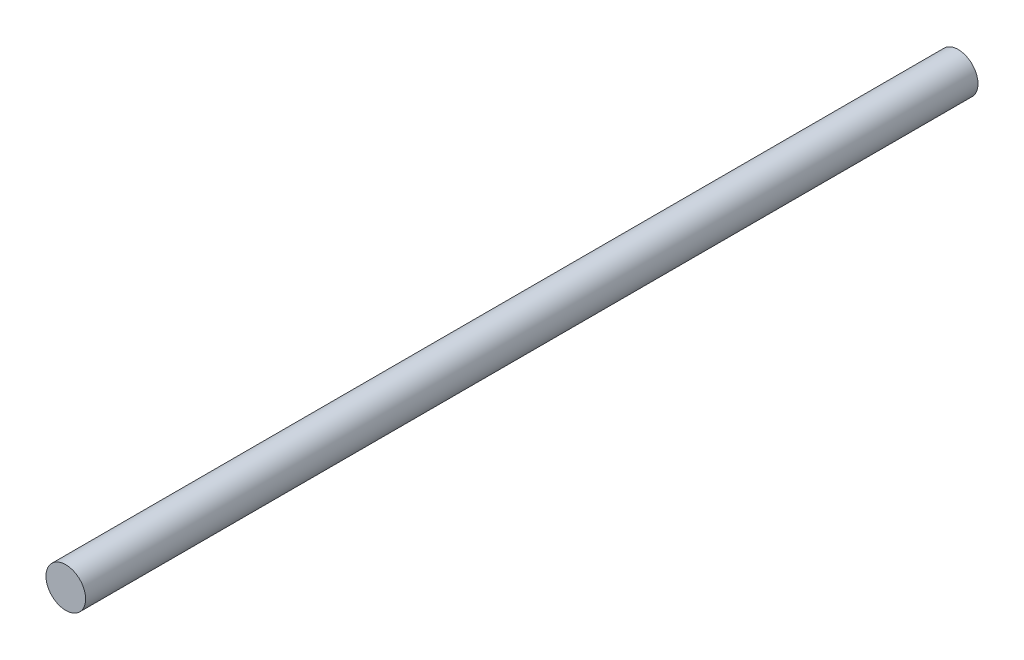
ISO-10303-21;
HEADER;
FILE_DESCRIPTION(('STEP AP214'),'2;1');
FILE_NAME('part.step','',(''),(''),'','','');
FILE_SCHEMA(('AUTOMOTIVE_DESIGN { 1 0 10303 214 1 1 1 1 }'));
ENDSEC;
DATA;
#1=APPLICATION_CONTEXT('core data for automotive mechanical design processes');
#2=APPLICATION_PROTOCOL_DEFINITION('international standard','automotive_design',2000,#1);
#3=PRODUCT_CONTEXT('',#1,'mechanical');
#4=PRODUCT('Part','Part','',(#3));
#5=PRODUCT_RELATED_PRODUCT_CATEGORY('part','',(#4));
#6=PRODUCT_DEFINITION_FORMATION('','',#4);
#7=PRODUCT_DEFINITION_CONTEXT('part definition',#1,'design');
#8=PRODUCT_DEFINITION('design','',#6,#7);
#9=PRODUCT_DEFINITION_SHAPE('','',#8);
#10=(LENGTH_UNIT() NAMED_UNIT(*) SI_UNIT(.MILLI.,.METRE.));
#11=(NAMED_UNIT(*) PLANE_ANGLE_UNIT() SI_UNIT($,.RADIAN.));
#12=(NAMED_UNIT(*) SI_UNIT($,.STERADIAN.) SOLID_ANGLE_UNIT());
#13=UNCERTAINTY_MEASURE_WITH_UNIT(LENGTH_MEASURE(1.E-05),#10,'distance_accuracy_value','');
#14=(GEOMETRIC_REPRESENTATION_CONTEXT(3) GLOBAL_UNCERTAINTY_ASSIGNED_CONTEXT((#13)) GLOBAL_UNIT_ASSIGNED_CONTEXT((#10,
#11,#12)) REPRESENTATION_CONTEXT('',''));
#15=CARTESIAN_POINT('',(0.,0.,0.));
#16=DIRECTION('',(0.,0.,1.));
#17=DIRECTION('',(1.,0.,0.));
#18=AXIS2_PLACEMENT_3D('',#15,#16,#17);
#19=CARTESIAN_POINT('',(0.,0.,90.));
#20=DIRECTION('',(0.,0.,-1.));
#21=DIRECTION('',(-1.,0.,0.));
#22=AXIS2_PLACEMENT_3D('',#19,#20,#21);
#23=CYLINDRICAL_SURFACE('',#22,2.);
#24=CARTESIAN_POINT('',(0.,0.,90.));
#25=DIRECTION('',(0.,0.,1.));
#26=DIRECTION('',(1.,0.,0.));
#27=AXIS2_PLACEMENT_3D('',#24,#25,#26);
#28=CIRCLE('',#27,2.);
#29=CARTESIAN_POINT('',(2.,0.,90.));
#30=VERTEX_POINT('',#29);
#31=EDGE_CURVE('E10',#30,#30,#28,.T.);
#32=ORIENTED_EDGE('',*,*,#31,.F.);
#33=EDGE_LOOP('',(#32));
#34=FACE_BOUND('',#33,.T.);
#35=CARTESIAN_POINT('',(0.,0.,0.));
#36=DIRECTION('',(0.,0.,1.));
#37=DIRECTION('',(1.,0.,0.));
#38=AXIS2_PLACEMENT_3D('',#35,#36,#37);
#39=CIRCLE('',#38,2.);
#40=CARTESIAN_POINT('',(2.,0.,0.));
#41=VERTEX_POINT('',#40);
#42=EDGE_CURVE('E40',#41,#41,#39,.T.);
#43=ORIENTED_EDGE('',*,*,#42,.T.);
#44=EDGE_LOOP('',(#43));
#45=FACE_BOUND('',#44,.T.);
#46=ADVANCED_FACE('F37',(#34,#45),#23,.T.);
#47=CARTESIAN_POINT('',(0.,0.,90.));
#48=DIRECTION('',(0.,0.,1.));
#49=DIRECTION('',(1.,0.,0.));
#50=AXIS2_PLACEMENT_3D('',#47,#48,#49);
#51=PLANE('',#50);
#52=ORIENTED_EDGE('',*,*,#31,.T.);
#53=EDGE_LOOP('',(#52));
#54=FACE_BOUND('',#53,.T.);
#55=ADVANCED_FACE('F54',(#54),#51,.T.);
#56=CARTESIAN_POINT('',(0.,0.,0.));
#57=DIRECTION('',(0.,0.,1.));
#58=DIRECTION('',(1.,0.,0.));
#59=AXIS2_PLACEMENT_3D('',#56,#57,#58);
#60=PLANE('',#59);
#61=ORIENTED_EDGE('',*,*,#42,.F.);
#62=EDGE_LOOP('',(#61));
#63=FACE_BOUND('',#62,.T.);
#64=ADVANCED_FACE('F52',(#63),#60,.F.);
#65=CLOSED_SHELL('',(#46,#55,#64));
#66=MANIFOLD_SOLID_BREP('B2',#65);
#67=ADVANCED_BREP_SHAPE_REPRESENTATION('',(#18,#66),#14);
#68=SHAPE_DEFINITION_REPRESENTATION(#9,#67);
ENDSEC;
END-ISO-10303-21;
